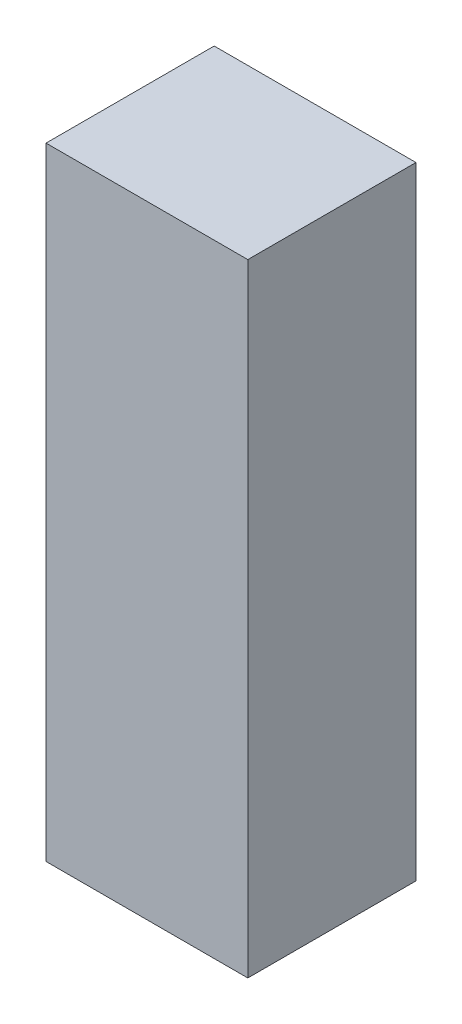
ISO-10303-21;
HEADER;
FILE_DESCRIPTION(('STEP AP214'),'2;1');
FILE_NAME('part.step','',(''),(''),'','','');
FILE_SCHEMA(('AUTOMOTIVE_DESIGN { 1 0 10303 214 1 1 1 1 }'));
ENDSEC;
DATA;
#1=APPLICATION_CONTEXT('core data for automotive mechanical design processes');
#2=APPLICATION_PROTOCOL_DEFINITION('international standard','automotive_design',2000,#1);
#3=PRODUCT_CONTEXT('',#1,'mechanical');
#4=PRODUCT('Part','Part','',(#3));
#5=PRODUCT_RELATED_PRODUCT_CATEGORY('part','',(#4));
#6=PRODUCT_DEFINITION_FORMATION('','',#4);
#7=PRODUCT_DEFINITION_CONTEXT('part definition',#1,'design');
#8=PRODUCT_DEFINITION('design','',#6,#7);
#9=PRODUCT_DEFINITION_SHAPE('','',#8);
#10=(LENGTH_UNIT() NAMED_UNIT(*) SI_UNIT(.MILLI.,.METRE.));
#11=(NAMED_UNIT(*) PLANE_ANGLE_UNIT() SI_UNIT($,.RADIAN.));
#12=(NAMED_UNIT(*) SI_UNIT($,.STERADIAN.) SOLID_ANGLE_UNIT());
#13=UNCERTAINTY_MEASURE_WITH_UNIT(LENGTH_MEASURE(1.E-05),#10,'distance_accuracy_value','');
#14=(GEOMETRIC_REPRESENTATION_CONTEXT(3) GLOBAL_UNCERTAINTY_ASSIGNED_CONTEXT((#13)) GLOBAL_UNIT_ASSIGNED_CONTEXT((#10,
#11,#12)) REPRESENTATION_CONTEXT('',''));
#15=CARTESIAN_POINT('',(0.,0.,0.));
#16=DIRECTION('',(0.,0.,1.));
#17=DIRECTION('',(1.,0.,0.));
#18=AXIS2_PLACEMENT_3D('',#15,#16,#17);
#19=CARTESIAN_POINT('',(-0.06,-0.485,0.));
#20=DIRECTION('',(1.,0.,0.));
#21=DIRECTION('',(0.,0.,1.));
#22=AXIS2_PLACEMENT_3D('',#19,#20,#21);
#23=PLANE('',#22);
#24=DIRECTION('',(0.,1.,0.));
#25=VECTOR('',#24,1.);
#26=CARTESIAN_POINT('',(-0.06,-0.485,0.1));
#27=LINE('',#26,#25);
#28=CARTESIAN_POINT('',(-0.06,-0.485,0.1));
#29=VERTEX_POINT('',#28);
#30=CARTESIAN_POINT('',(-0.06,-0.115,0.1));
#31=VERTEX_POINT('',#30);
#32=EDGE_CURVE('E11',#29,#31,#27,.T.);
#33=ORIENTED_EDGE('',*,*,#32,.T.);
#34=DIRECTION('',(0.,0.,1.));
#35=VECTOR('',#34,1.);
#36=CARTESIAN_POINT('',(-0.06,-0.115,0.));
#37=LINE('',#36,#35);
#38=CARTESIAN_POINT('',(-0.06,-0.115,0.));
#39=VERTEX_POINT('',#38);
#40=EDGE_CURVE('E24',#39,#31,#37,.T.);
#41=ORIENTED_EDGE('',*,*,#40,.F.);
#42=DIRECTION('',(0.,1.,0.));
#43=VECTOR('',#42,1.);
#44=CARTESIAN_POINT('',(-0.06,-0.485,0.));
#45=LINE('',#44,#43);
#46=CARTESIAN_POINT('',(-0.06,-0.485,0.));
#47=VERTEX_POINT('',#46);
#48=EDGE_CURVE('E86',#47,#39,#45,.T.);
#49=ORIENTED_EDGE('',*,*,#48,.F.);
#50=DIRECTION('',(0.,0.,1.));
#51=VECTOR('',#50,1.);
#52=CARTESIAN_POINT('',(-0.06,-0.485,0.));
#53=LINE('',#52,#51);
#54=EDGE_CURVE('E36',#47,#29,#53,.T.);
#55=ORIENTED_EDGE('',*,*,#54,.T.);
#56=EDGE_LOOP('',(#33,#41,#49,#55));
#57=FACE_BOUND('',#56,.T.);
#58=ADVANCED_FACE('F17',(#57),#23,.F.);
#59=CARTESIAN_POINT('',(0.06,-0.485,0.));
#60=DIRECTION('',(1.,0.,0.));
#61=DIRECTION('',(0.,0.,1.));
#62=AXIS2_PLACEMENT_3D('',#59,#60,#61);
#63=PLANE('',#62);
#64=DIRECTION('',(0.,0.,1.));
#65=VECTOR('',#64,1.);
#66=CARTESIAN_POINT('',(0.06,-0.485,0.));
#67=LINE('',#66,#65);
#68=CARTESIAN_POINT('',(0.06,-0.485,0.));
#69=VERTEX_POINT('',#68);
#70=CARTESIAN_POINT('',(0.06,-0.485,0.1));
#71=VERTEX_POINT('',#70);
#72=EDGE_CURVE('E83',#69,#71,#67,.T.);
#73=ORIENTED_EDGE('',*,*,#72,.F.);
#74=DIRECTION('',(0.,1.,0.));
#75=VECTOR('',#74,1.);
#76=CARTESIAN_POINT('',(0.06,-0.485,0.));
#77=LINE('',#76,#75);
#78=CARTESIAN_POINT('',(0.06,-0.115,0.));
#79=VERTEX_POINT('',#78);
#80=EDGE_CURVE('E63',#69,#79,#77,.T.);
#81=ORIENTED_EDGE('',*,*,#80,.T.);
#82=DIRECTION('',(0.,0.,1.));
#83=VECTOR('',#82,1.);
#84=CARTESIAN_POINT('',(0.06,-0.115,0.));
#85=LINE('',#84,#83);
#86=CARTESIAN_POINT('',(0.06,-0.115,0.1));
#87=VERTEX_POINT('',#86);
#88=EDGE_CURVE('E57',#79,#87,#85,.T.);
#89=ORIENTED_EDGE('',*,*,#88,.T.);
#90=DIRECTION('',(0.,1.,0.));
#91=VECTOR('',#90,1.);
#92=CARTESIAN_POINT('',(0.06,-0.485,0.1));
#93=LINE('',#92,#91);
#94=EDGE_CURVE('E60',#71,#87,#93,.T.);
#95=ORIENTED_EDGE('',*,*,#94,.F.);
#96=EDGE_LOOP('',(#73,#81,#89,#95));
#97=FACE_BOUND('',#96,.T.);
#98=ADVANCED_FACE('F59',(#97),#63,.T.);
#99=CARTESIAN_POINT('',(-0.06,-0.485,0.));
#100=DIRECTION('',(0.,1.,0.));
#101=DIRECTION('',(0.,0.,1.));
#102=AXIS2_PLACEMENT_3D('',#99,#100,#101);
#103=PLANE('',#102);
#104=ORIENTED_EDGE('',*,*,#72,.T.);
#105=DIRECTION('',(1.,0.,0.));
#106=VECTOR('',#105,1.);
#107=CARTESIAN_POINT('',(-0.06,-0.485,0.1));
#108=LINE('',#107,#106);
#109=EDGE_CURVE('E71',#29,#71,#108,.T.);
#110=ORIENTED_EDGE('',*,*,#109,.F.);
#111=ORIENTED_EDGE('',*,*,#54,.F.);
#112=DIRECTION('',(1.,0.,0.));
#113=VECTOR('',#112,1.);
#114=CARTESIAN_POINT('',(-0.06,-0.485,0.));
#115=LINE('',#114,#113);
#116=EDGE_CURVE('E76',#47,#69,#115,.T.);
#117=ORIENTED_EDGE('',*,*,#116,.T.);
#118=EDGE_LOOP('',(#104,#110,#111,#117));
#119=FACE_BOUND('',#118,.T.);
#120=ADVANCED_FACE('F91',(#119),#103,.F.);
#121=CARTESIAN_POINT('',(-0.06,-0.115,0.));
#122=DIRECTION('',(0.,1.,0.));
#123=DIRECTION('',(0.,0.,1.));
#124=AXIS2_PLACEMENT_3D('',#121,#122,#123);
#125=PLANE('',#124);
#126=DIRECTION('',(1.,0.,0.));
#127=VECTOR('',#126,1.);
#128=CARTESIAN_POINT('',(-0.06,-0.115,0.));
#129=LINE('',#128,#127);
#130=EDGE_CURVE('E74',#39,#79,#129,.T.);
#131=ORIENTED_EDGE('',*,*,#130,.F.);
#132=ORIENTED_EDGE('',*,*,#40,.T.);
#133=DIRECTION('',(1.,0.,0.));
#134=VECTOR('',#133,1.);
#135=CARTESIAN_POINT('',(-0.06,-0.115,0.1));
#136=LINE('',#135,#134);
#137=EDGE_CURVE('E69',#31,#87,#136,.T.);
#138=ORIENTED_EDGE('',*,*,#137,.T.);
#139=ORIENTED_EDGE('',*,*,#88,.F.);
#140=EDGE_LOOP('',(#131,#132,#138,#139));
#141=FACE_BOUND('',#140,.T.);
#142=ADVANCED_FACE('F73',(#141),#125,.T.);
#143=CARTESIAN_POINT('',(-0.06,-0.485,0.));
#144=DIRECTION('',(0.,0.,1.));
#145=DIRECTION('',(1.,0.,0.));
#146=AXIS2_PLACEMENT_3D('',#143,#144,#145);
#147=PLANE('',#146);
#148=ORIENTED_EDGE('',*,*,#130,.T.);
#149=ORIENTED_EDGE('',*,*,#80,.F.);
#150=ORIENTED_EDGE('',*,*,#116,.F.);
#151=ORIENTED_EDGE('',*,*,#48,.T.);
#152=EDGE_LOOP('',(#148,#149,#150,#151));
#153=FACE_BOUND('',#152,.T.);
#154=ADVANCED_FACE('F89',(#153),#147,.F.);
#155=CARTESIAN_POINT('',(-0.06,-0.485,0.1));
#156=DIRECTION('',(0.,0.,1.));
#157=DIRECTION('',(1.,0.,0.));
#158=AXIS2_PLACEMENT_3D('',#155,#156,#157);
#159=PLANE('',#158);
#160=ORIENTED_EDGE('',*,*,#32,.F.);
#161=ORIENTED_EDGE('',*,*,#109,.T.);
#162=ORIENTED_EDGE('',*,*,#94,.T.);
#163=ORIENTED_EDGE('',*,*,#137,.F.);
#164=EDGE_LOOP('',(#160,#161,#162,#163));
#165=FACE_BOUND('',#164,.T.);
#166=ADVANCED_FACE('F68',(#165),#159,.T.);
#167=CLOSED_SHELL('',(#58,#98,#120,#142,#154,#166));
#168=MANIFOLD_SOLID_BREP('B1',#167);
#169=ADVANCED_BREP_SHAPE_REPRESENTATION('',(#18,#168),#14);
#170=SHAPE_DEFINITION_REPRESENTATION(#9,#169);
ENDSEC;
END-ISO-10303-21;
